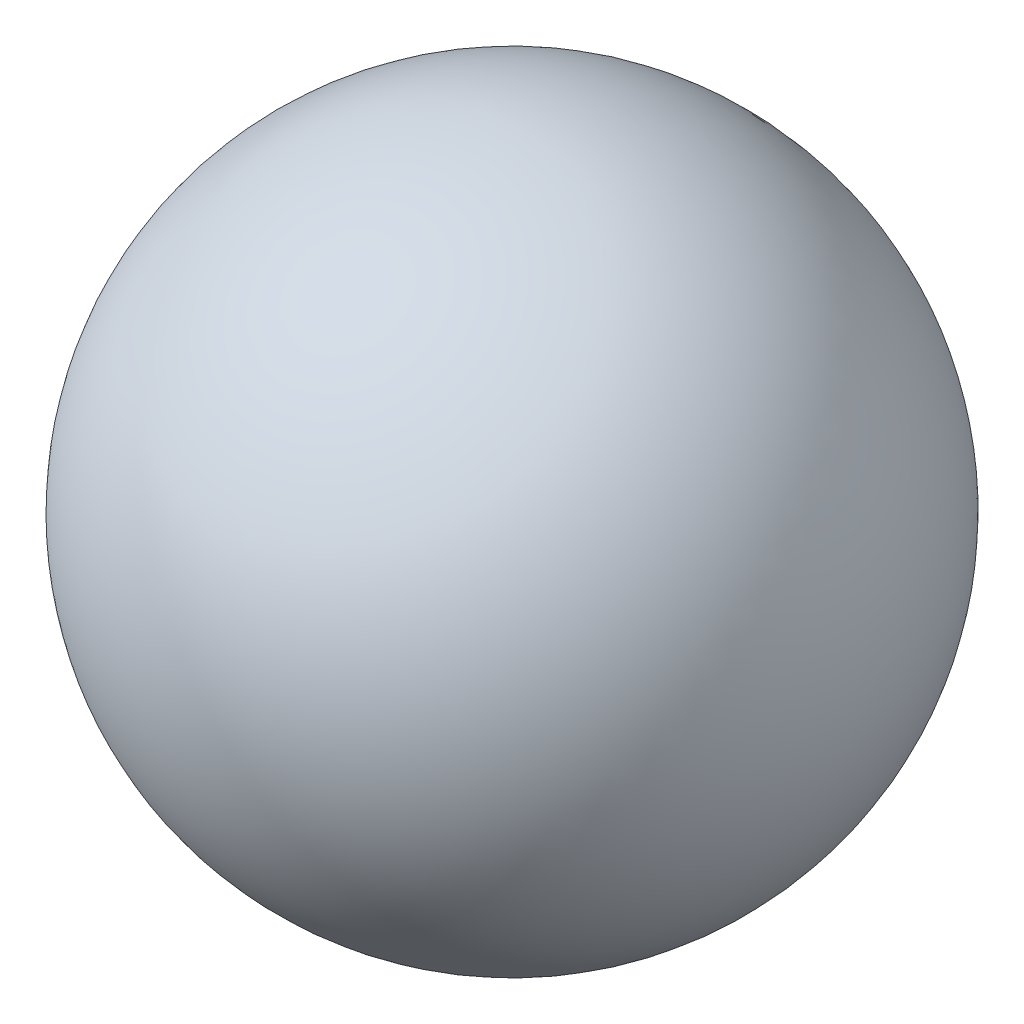
ISO-10303-21;
HEADER;
FILE_DESCRIPTION(('STEP AP214'),'2;1');
FILE_NAME('part.step','',(''),(''),'','','');
FILE_SCHEMA(('AUTOMOTIVE_DESIGN { 1 0 10303 214 1 1 1 1 }'));
ENDSEC;
DATA;
#1=APPLICATION_CONTEXT('core data for automotive mechanical design processes');
#2=APPLICATION_PROTOCOL_DEFINITION('international standard','automotive_design',2000,#1);
#3=PRODUCT_CONTEXT('',#1,'mechanical');
#4=PRODUCT('Part','Part','',(#3));
#5=PRODUCT_RELATED_PRODUCT_CATEGORY('part','',(#4));
#6=PRODUCT_DEFINITION_FORMATION('','',#4);
#7=PRODUCT_DEFINITION_CONTEXT('part definition',#1,'design');
#8=PRODUCT_DEFINITION('design','',#6,#7);
#9=PRODUCT_DEFINITION_SHAPE('','',#8);
#10=(LENGTH_UNIT() NAMED_UNIT(*) SI_UNIT(.MILLI.,.METRE.));
#11=(NAMED_UNIT(*) PLANE_ANGLE_UNIT() SI_UNIT($,.RADIAN.));
#12=(NAMED_UNIT(*) SI_UNIT($,.STERADIAN.) SOLID_ANGLE_UNIT());
#13=UNCERTAINTY_MEASURE_WITH_UNIT(LENGTH_MEASURE(1.E-05),#10,'distance_accuracy_value','');
#14=(GEOMETRIC_REPRESENTATION_CONTEXT(3) GLOBAL_UNCERTAINTY_ASSIGNED_CONTEXT((#13)) GLOBAL_UNIT_ASSIGNED_CONTEXT((#10,
#11,#12)) REPRESENTATION_CONTEXT('',''));
#15=CARTESIAN_POINT('',(0.,0.,0.));
#16=DIRECTION('',(0.,0.,1.));
#17=DIRECTION('',(1.,0.,0.));
#18=AXIS2_PLACEMENT_3D('',#15,#16,#17);
#19=CARTESIAN_POINT('',(67.76,-18.1262968593183,-66.9366350993077));
#20=DIRECTION('',(0.,-0.261383566232645,-0.965235013508889));
#21=DIRECTION('',(0.173648177666933,0.950570924782397,-0.257412562535889));
#22=AXIS2_PLACEMENT_3D('',#19,#20,#21);
#23=SPHERICAL_SURFACE('',#22,7.15);
#24=CARTESIAN_POINT('',(67.76,-19.9951893578817,-73.8380654458962));
#25=VERTEX_POINT('',#24);
#26=VERTEX_LOOP('',#25);
#27=FACE_BOUND('',#26,.T.);
#28=CARTESIAN_POINT('',(67.76,-16.2574043607549,-60.0352047527191));
#29=VERTEX_POINT('',#28);
#30=VERTEX_LOOP('',#29);
#31=FACE_BOUND('',#30,.T.);
#32=ADVANCED_FACE('F16',(#27,#31),#23,.T.);
#33=CLOSED_SHELL('',(#32));
#34=MANIFOLD_SOLID_BREP('B1',#33);
#35=ADVANCED_BREP_SHAPE_REPRESENTATION('',(#18,#34),#14);
#36=SHAPE_DEFINITION_REPRESENTATION(#9,#35);
ENDSEC;
END-ISO-10303-21;
